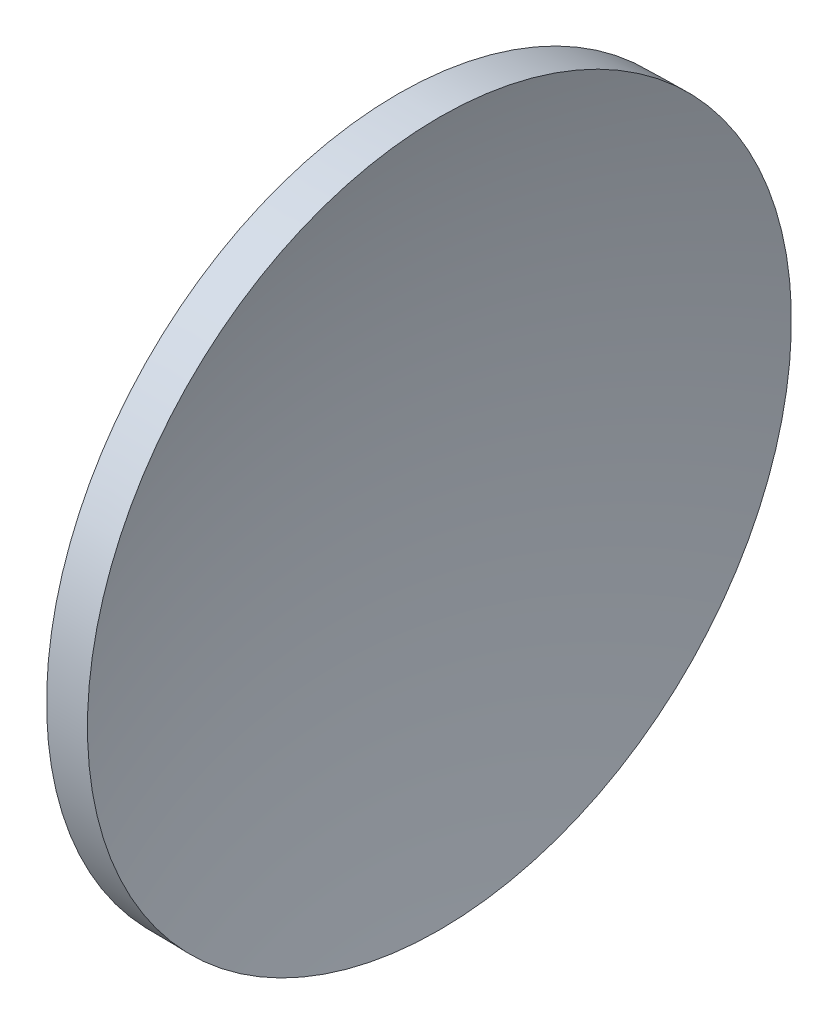
ISO-10303-21;
HEADER;
FILE_DESCRIPTION(('STEP AP214'),'2;1');
FILE_NAME('part.step','',(''),(''),'','','');
FILE_SCHEMA(('AUTOMOTIVE_DESIGN { 1 0 10303 214 1 1 1 1 }'));
ENDSEC;
DATA;
#1=APPLICATION_CONTEXT('core data for automotive mechanical design processes');
#2=APPLICATION_PROTOCOL_DEFINITION('international standard','automotive_design',2000,#1);
#3=PRODUCT_CONTEXT('',#1,'mechanical');
#4=PRODUCT('Part','Part','',(#3));
#5=PRODUCT_RELATED_PRODUCT_CATEGORY('part','',(#4));
#6=PRODUCT_DEFINITION_FORMATION('','',#4);
#7=PRODUCT_DEFINITION_CONTEXT('part definition',#1,'design');
#8=PRODUCT_DEFINITION('design','',#6,#7);
#9=PRODUCT_DEFINITION_SHAPE('','',#8);
#10=(LENGTH_UNIT() NAMED_UNIT(*) SI_UNIT(.MILLI.,.METRE.));
#11=(NAMED_UNIT(*) PLANE_ANGLE_UNIT() SI_UNIT($,.RADIAN.));
#12=(NAMED_UNIT(*) SI_UNIT($,.STERADIAN.) SOLID_ANGLE_UNIT());
#13=UNCERTAINTY_MEASURE_WITH_UNIT(LENGTH_MEASURE(1.E-05),#10,'distance_accuracy_value','');
#14=(GEOMETRIC_REPRESENTATION_CONTEXT(3) GLOBAL_UNCERTAINTY_ASSIGNED_CONTEXT((#13)) GLOBAL_UNIT_ASSIGNED_CONTEXT((#10,
#11,#12)) REPRESENTATION_CONTEXT('',''));
#15=CARTESIAN_POINT('',(0.,0.,0.));
#16=DIRECTION('',(0.,0.,1.));
#17=DIRECTION('',(1.,0.,0.));
#18=AXIS2_PLACEMENT_3D('',#15,#16,#17);
#19=CARTESIAN_POINT('',(167.567486245127,65.2168404709403,0.));
#20=DIRECTION('',(-1.,0.,0.));
#21=DIRECTION('',(0.,1.,0.));
#22=AXIS2_PLACEMENT_3D('',#19,#20,#21);
#23=SPHERICAL_SURFACE('',#22,42.5);
#24=CARTESIAN_POINT('',(126.955628497347,65.2168404709403,0.));
#25=DIRECTION('',(-1.,0.,0.));
#26=DIRECTION('',(0.,-1.,0.));
#27=AXIS2_PLACEMENT_3D('',#24,#25,#26);
#28=CIRCLE('',#27,12.5270511403926);
#29=CARTESIAN_POINT('',(126.955628497347,52.6897893305477,0.));
#30=VERTEX_POINT('',#29);
#31=EDGE_CURVE('E10',#30,#30,#28,.T.);
#32=ORIENTED_EDGE('',*,*,#31,.F.);
#33=EDGE_LOOP('',(#32));
#34=FACE_BOUND('',#33,.T.);
#35=ADVANCED_FACE('F35',(#34),#23,.F.);
#36=CARTESIAN_POINT('',(126.955628497347,65.2168404709403,0.));
#37=DIRECTION('',(1.,0.,0.));
#38=DIRECTION('',(0.,1.,0.));
#39=AXIS2_PLACEMENT_3D('',#36,#37,#38);
#40=CONICAL_SURFACE('',#39,12.5270511403926,0.014325874949705);
#41=CARTESIAN_POINT('',(125.480639546959,65.2168404709403,0.));
#42=DIRECTION('',(-1.,0.,0.));
#43=DIRECTION('',(0.,-1.,0.));
#44=AXIS2_PLACEMENT_3D('',#41,#42,#43);
#45=CIRCLE('',#44,12.5059191874756);
#46=CARTESIAN_POINT('',(125.480639546959,52.7109212834647,0.));
#47=VERTEX_POINT('',#46);
#48=EDGE_CURVE('E41',#47,#47,#45,.T.);
#49=ORIENTED_EDGE('',*,*,#48,.F.);
#50=EDGE_LOOP('',(#49));
#51=FACE_BOUND('',#50,.T.);
#52=ORIENTED_EDGE('',*,*,#31,.T.);
#53=EDGE_LOOP('',(#52));
#54=FACE_BOUND('',#53,.T.);
#55=ADVANCED_FACE('F49',(#51,#54),#40,.T.);
#56=CARTESIAN_POINT('',(150.867486245128,65.2168404709403,0.));
#57=DIRECTION('',(-1.,0.,0.));
#58=DIRECTION('',(0.,1.,0.));
#59=AXIS2_PLACEMENT_3D('',#56,#57,#58);
#60=SPHERICAL_SURFACE('',#59,28.3);
#61=ORIENTED_EDGE('',*,*,#48,.T.);
#62=EDGE_LOOP('',(#61));
#63=FACE_BOUND('',#62,.T.);
#64=ADVANCED_FACE('F47',(#63),#60,.T.);
#65=CLOSED_SHELL('',(#35,#55,#64));
#66=MANIFOLD_SOLID_BREP('B2',#65);
#67=ADVANCED_BREP_SHAPE_REPRESENTATION('',(#18,#66),#14);
#68=SHAPE_DEFINITION_REPRESENTATION(#9,#67);
ENDSEC;
END-ISO-10303-21;
